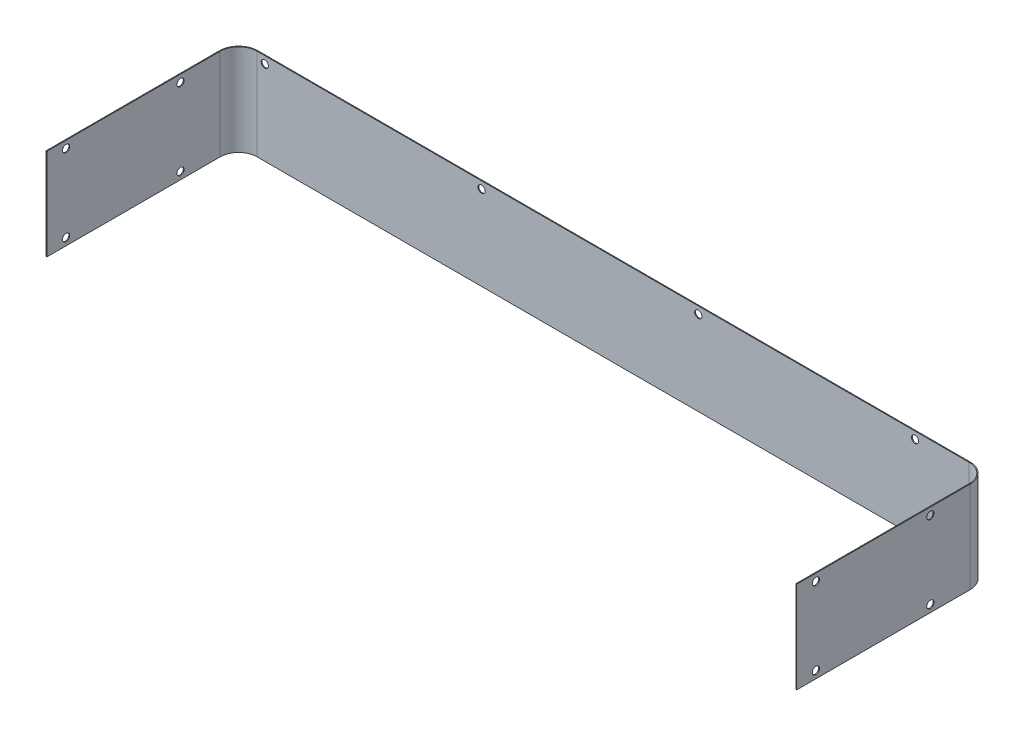
ISO-10303-21;
HEADER;
FILE_DESCRIPTION(('STEP AP214'),'2;1');
FILE_NAME('part.step','',(''),(''),'','','');
FILE_SCHEMA(('AUTOMOTIVE_DESIGN { 1 0 10303 214 1 1 1 1 }'));
ENDSEC;
DATA;
#1=APPLICATION_CONTEXT('core data for automotive mechanical design processes');
#2=APPLICATION_PROTOCOL_DEFINITION('international standard','automotive_design',2000,#1);
#3=PRODUCT_CONTEXT('',#1,'mechanical');
#4=PRODUCT('Part','Part','',(#3));
#5=PRODUCT_RELATED_PRODUCT_CATEGORY('part','',(#4));
#6=PRODUCT_DEFINITION_FORMATION('','',#4);
#7=PRODUCT_DEFINITION_CONTEXT('part definition',#1,'design');
#8=PRODUCT_DEFINITION('design','',#6,#7);
#9=PRODUCT_DEFINITION_SHAPE('','',#8);
#10=(LENGTH_UNIT() NAMED_UNIT(*) SI_UNIT(.MILLI.,.METRE.));
#11=(NAMED_UNIT(*) PLANE_ANGLE_UNIT() SI_UNIT($,.RADIAN.));
#12=(NAMED_UNIT(*) SI_UNIT($,.STERADIAN.) SOLID_ANGLE_UNIT());
#13=UNCERTAINTY_MEASURE_WITH_UNIT(LENGTH_MEASURE(1.E-05),#10,'distance_accuracy_value','');
#14=(GEOMETRIC_REPRESENTATION_CONTEXT(3) GLOBAL_UNCERTAINTY_ASSIGNED_CONTEXT((#13)) GLOBAL_UNIT_ASSIGNED_CONTEXT((#10,
#11,#12)) REPRESENTATION_CONTEXT('',''));
#15=CARTESIAN_POINT('',(0.,0.,0.));
#16=DIRECTION('',(0.,0.,1.));
#17=DIRECTION('',(1.,0.,0.));
#18=AXIS2_PLACEMENT_3D('',#15,#16,#17);
#19=CARTESIAN_POINT('',(16.,76.,-160.));
#20=DIRECTION('',(0.,1.,0.));
#21=DIRECTION('',(0.,0.,1.));
#22=AXIS2_PLACEMENT_3D('',#19,#20,#21);
#23=PLANE('',#22);
#24=DIRECTION('',(0.,0.,1.));
#25=VECTOR('',#24,1.);
#26=CARTESIAN_POINT('',(16.,76.,-160.));
#27=LINE('',#26,#25);
#28=CARTESIAN_POINT('',(16.,76.,-160.));
#29=VERTEX_POINT('',#28);
#30=CARTESIAN_POINT('',(16.,76.,-159.3));
#31=VERTEX_POINT('',#30);
#32=EDGE_CURVE('E11',#29,#31,#27,.T.);
#33=ORIENTED_EDGE('',*,*,#32,.F.);
#34=CARTESIAN_POINT('',(16.,76.,-144.));
#35=DIRECTION('',(0.,-1.,0.));
#36=DIRECTION('',(0.,0.,-1.));
#37=AXIS2_PLACEMENT_3D('',#34,#35,#36);
#38=CIRCLE('',#37,16.);
#39=CARTESIAN_POINT('',(0.,76.,-144.));
#40=VERTEX_POINT('',#39);
#41=EDGE_CURVE('E305',#40,#29,#38,.T.);
#42=ORIENTED_EDGE('',*,*,#41,.F.);
#43=DIRECTION('',(-1.,0.,0.));
#44=VECTOR('',#43,1.);
#45=CARTESIAN_POINT('',(0.70000000000002,76.,-144.));
#46=LINE('',#45,#44);
#47=CARTESIAN_POINT('',(0.70000000000002,76.,-144.));
#48=VERTEX_POINT('',#47);
#49=EDGE_CURVE('E47',#48,#40,#46,.T.);
#50=ORIENTED_EDGE('',*,*,#49,.F.);
#51=CARTESIAN_POINT('',(16.,76.,-144.));
#52=DIRECTION('',(0.,1.,0.));
#53=DIRECTION('',(1.,0.,0.));
#54=AXIS2_PLACEMENT_3D('',#51,#52,#53);
#55=CIRCLE('',#54,15.3);
#56=EDGE_CURVE('E149',#48,#31,#55,.F.);
#57=ORIENTED_EDGE('',*,*,#56,.T.);
#58=EDGE_LOOP('',(#33,#42,#50,#57));
#59=FACE_BOUND('',#58,.T.);
#60=ADVANCED_FACE('F38',(#59),#23,.T.);
#61=CARTESIAN_POINT('',(0.70000000000002,76.,-144.));
#62=DIRECTION('',(0.,1.,0.));
#63=DIRECTION('',(0.,0.,1.));
#64=AXIS2_PLACEMENT_3D('',#61,#62,#63);
#65=PLANE('',#64);
#66=DIRECTION('',(1.,0.,0.));
#67=VECTOR('',#66,1.);
#68=CARTESIAN_POINT('',(16.,76.,-160.));
#69=LINE('',#68,#67);
#70=CARTESIAN_POINT('',(607.4,76.,-160.));
#71=VERTEX_POINT('',#70);
#72=EDGE_CURVE('E143',#29,#71,#69,.T.);
#73=ORIENTED_EDGE('',*,*,#72,.F.);
#74=ORIENTED_EDGE('',*,*,#32,.T.);
#75=DIRECTION('',(1.,0.,0.));
#76=VECTOR('',#75,1.);
#77=CARTESIAN_POINT('',(16.,76.,-159.3));
#78=LINE('',#77,#76);
#79=CARTESIAN_POINT('',(607.4,76.,-159.3));
#80=VERTEX_POINT('',#79);
#81=EDGE_CURVE('E140',#31,#80,#78,.T.);
#82=ORIENTED_EDGE('',*,*,#81,.T.);
#83=DIRECTION('',(0.,0.,-1.));
#84=VECTOR('',#83,1.);
#85=CARTESIAN_POINT('',(607.4,76.,-159.3));
#86=LINE('',#85,#84);
#87=EDGE_CURVE('E232',#80,#71,#86,.T.);
#88=ORIENTED_EDGE('',*,*,#87,.T.);
#89=EDGE_LOOP('',(#73,#74,#82,#88));
#90=FACE_BOUND('',#89,.T.);
#91=ADVANCED_FACE('F138',(#90),#65,.T.);
#92=CARTESIAN_POINT('',(0.,0.,-144.));
#93=DIRECTION('',(0.,-1.,0.));
#94=DIRECTION('',(0.,0.,-1.));
#95=AXIS2_PLACEMENT_3D('',#92,#93,#94);
#96=PLANE('',#95);
#97=DIRECTION('',(1.,0.,0.));
#98=VECTOR('',#97,1.);
#99=CARTESIAN_POINT('',(0.,0.,-144.));
#100=LINE('',#99,#98);
#101=CARTESIAN_POINT('',(0.,0.,-144.));
#102=VERTEX_POINT('',#101);
#103=CARTESIAN_POINT('',(0.70000000000002,0.,-144.));
#104=VERTEX_POINT('',#103);
#105=EDGE_CURVE('E237',#102,#104,#100,.T.);
#106=ORIENTED_EDGE('',*,*,#105,.F.);
#107=CARTESIAN_POINT('',(16.,0.,-144.));
#108=DIRECTION('',(0.,-1.,0.));
#109=DIRECTION('',(0.,0.,-1.));
#110=AXIS2_PLACEMENT_3D('',#107,#108,#109);
#111=CIRCLE('',#110,16.);
#112=CARTESIAN_POINT('',(16.,0.,-160.));
#113=VERTEX_POINT('',#112);
#114=EDGE_CURVE('E189',#102,#113,#111,.T.);
#115=ORIENTED_EDGE('',*,*,#114,.T.);
#116=DIRECTION('',(0.,0.,-1.));
#117=VECTOR('',#116,1.);
#118=CARTESIAN_POINT('',(16.,0.,-159.3));
#119=LINE('',#118,#117);
#120=CARTESIAN_POINT('',(16.,0.,-159.3));
#121=VERTEX_POINT('',#120);
#122=EDGE_CURVE('E235',#121,#113,#119,.T.);
#123=ORIENTED_EDGE('',*,*,#122,.F.);
#124=CARTESIAN_POINT('',(16.,0.,-144.));
#125=DIRECTION('',(0.,1.,0.));
#126=DIRECTION('',(1.,0.,0.));
#127=AXIS2_PLACEMENT_3D('',#124,#125,#126);
#128=CIRCLE('',#127,15.3);
#129=EDGE_CURVE('E161',#104,#121,#128,.F.);
#130=ORIENTED_EDGE('',*,*,#129,.F.);
#131=EDGE_LOOP('',(#106,#115,#123,#130));
#132=FACE_BOUND('',#131,.T.);
#133=ADVANCED_FACE('F323',(#132),#96,.T.);
#134=CARTESIAN_POINT('',(16.,0.,-159.3));
#135=DIRECTION('',(0.,-1.,0.));
#136=DIRECTION('',(0.,0.,-1.));
#137=AXIS2_PLACEMENT_3D('',#134,#135,#136);
#138=PLANE('',#137);
#139=DIRECTION('',(0.,0.,-1.));
#140=VECTOR('',#139,1.);
#141=CARTESIAN_POINT('',(0.,0.,0.));
#142=LINE('',#141,#140);
#143=CARTESIAN_POINT('',(0.,0.,0.));
#144=VERTEX_POINT('',#143);
#145=EDGE_CURVE('E192',#144,#102,#142,.T.);
#146=ORIENTED_EDGE('',*,*,#145,.T.);
#147=ORIENTED_EDGE('',*,*,#105,.T.);
#148=DIRECTION('',(0.,0.,-1.));
#149=VECTOR('',#148,1.);
#150=CARTESIAN_POINT('',(0.7,0.,0.));
#151=LINE('',#150,#149);
#152=CARTESIAN_POINT('',(0.7,0.,0.));
#153=VERTEX_POINT('',#152);
#154=EDGE_CURVE('E198',#153,#104,#151,.T.);
#155=ORIENTED_EDGE('',*,*,#154,.F.);
#156=DIRECTION('',(-1.,0.,0.));
#157=VECTOR('',#156,1.);
#158=CARTESIAN_POINT('',(0.7,0.,0.));
#159=LINE('',#158,#157);
#160=EDGE_CURVE('E195',#153,#144,#159,.T.);
#161=ORIENTED_EDGE('',*,*,#160,.T.);
#162=EDGE_LOOP('',(#146,#147,#155,#161));
#163=FACE_BOUND('',#162,.T.);
#164=ADVANCED_FACE('F370',(#163),#138,.T.);
#165=CARTESIAN_POINT('',(623.4,76.,-144.));
#166=DIRECTION('',(0.,1.,0.));
#167=DIRECTION('',(0.,0.,1.));
#168=AXIS2_PLACEMENT_3D('',#165,#166,#167);
#169=PLANE('',#168);
#170=DIRECTION('',(-1.,0.,0.));
#171=VECTOR('',#170,1.);
#172=CARTESIAN_POINT('',(623.4,76.,-144.));
#173=LINE('',#172,#171);
#174=CARTESIAN_POINT('',(623.4,76.,-144.));
#175=VERTEX_POINT('',#174);
#176=CARTESIAN_POINT('',(622.7,76.,-144.));
#177=VERTEX_POINT('',#176);
#178=EDGE_CURVE('E56',#175,#177,#173,.T.);
#179=ORIENTED_EDGE('',*,*,#178,.F.);
#180=CARTESIAN_POINT('',(607.4,76.,-144.));
#181=DIRECTION('',(0.,-1.,0.));
#182=DIRECTION('',(0.,0.,-1.));
#183=AXIS2_PLACEMENT_3D('',#180,#181,#182);
#184=CIRCLE('',#183,16.);
#185=EDGE_CURVE('E301',#71,#175,#184,.T.);
#186=ORIENTED_EDGE('',*,*,#185,.F.);
#187=ORIENTED_EDGE('',*,*,#87,.F.);
#188=CARTESIAN_POINT('',(607.4,76.,-144.));
#189=DIRECTION('',(0.,1.,0.));
#190=DIRECTION('',(1.,0.,0.));
#191=AXIS2_PLACEMENT_3D('',#188,#189,#190);
#192=CIRCLE('',#191,15.3);
#193=EDGE_CURVE('E169',#80,#177,#192,.F.);
#194=ORIENTED_EDGE('',*,*,#193,.T.);
#195=EDGE_LOOP('',(#179,#186,#187,#194));
#196=FACE_BOUND('',#195,.T.);
#197=ADVANCED_FACE('F375',(#196),#169,.T.);
#198=CARTESIAN_POINT('',(607.4,76.,-159.3));
#199=DIRECTION('',(0.,1.,0.));
#200=DIRECTION('',(0.,0.,1.));
#201=AXIS2_PLACEMENT_3D('',#198,#199,#200);
#202=PLANE('',#201);
#203=DIRECTION('',(0.,0.,1.));
#204=VECTOR('',#203,1.);
#205=CARTESIAN_POINT('',(623.4,76.,-144.));
#206=LINE('',#205,#204);
#207=CARTESIAN_POINT('',(623.4,76.,0.));
#208=VERTEX_POINT('',#207);
#209=EDGE_CURVE('E298',#175,#208,#206,.T.);
#210=ORIENTED_EDGE('',*,*,#209,.F.);
#211=ORIENTED_EDGE('',*,*,#178,.T.);
#212=DIRECTION('',(0.,0.,-1.));
#213=VECTOR('',#212,1.);
#214=CARTESIAN_POINT('',(622.7,76.,-144.));
#215=LINE('',#214,#213);
#216=CARTESIAN_POINT('',(622.7,76.,0.));
#217=VERTEX_POINT('',#216);
#218=EDGE_CURVE('E110',#177,#217,#215,.F.);
#219=ORIENTED_EDGE('',*,*,#218,.T.);
#220=DIRECTION('',(-1.,0.,0.));
#221=VECTOR('',#220,1.);
#222=CARTESIAN_POINT('',(623.4,76.,0.));
#223=LINE('',#222,#221);
#224=EDGE_CURVE('E295',#208,#217,#223,.T.);
#225=ORIENTED_EDGE('',*,*,#224,.F.);
#226=EDGE_LOOP('',(#210,#211,#219,#225));
#227=FACE_BOUND('',#226,.T.);
#228=ADVANCED_FACE('F350',(#227),#202,.T.);
#229=CARTESIAN_POINT('',(607.4,0.,-160.));
#230=DIRECTION('',(0.,-1.,0.));
#231=DIRECTION('',(0.,0.,-1.));
#232=AXIS2_PLACEMENT_3D('',#229,#230,#231);
#233=PLANE('',#232);
#234=DIRECTION('',(0.,0.,1.));
#235=VECTOR('',#234,1.);
#236=CARTESIAN_POINT('',(607.4,0.,-160.));
#237=LINE('',#236,#235);
#238=CARTESIAN_POINT('',(607.4,0.,-160.));
#239=VERTEX_POINT('',#238);
#240=CARTESIAN_POINT('',(607.4,0.,-159.3));
#241=VERTEX_POINT('',#240);
#242=EDGE_CURVE('E97',#239,#241,#237,.T.);
#243=ORIENTED_EDGE('',*,*,#242,.F.);
#244=CARTESIAN_POINT('',(607.4,0.,-144.));
#245=DIRECTION('',(0.,-1.,0.));
#246=DIRECTION('',(0.,0.,-1.));
#247=AXIS2_PLACEMENT_3D('',#244,#245,#246);
#248=CIRCLE('',#247,16.);
#249=CARTESIAN_POINT('',(623.4,0.,-144.));
#250=VERTEX_POINT('',#249);
#251=EDGE_CURVE('E185',#239,#250,#248,.T.);
#252=ORIENTED_EDGE('',*,*,#251,.T.);
#253=DIRECTION('',(1.,0.,0.));
#254=VECTOR('',#253,1.);
#255=CARTESIAN_POINT('',(622.7,0.,-144.));
#256=LINE('',#255,#254);
#257=CARTESIAN_POINT('',(622.7,0.,-144.));
#258=VERTEX_POINT('',#257);
#259=EDGE_CURVE('E104',#258,#250,#256,.T.);
#260=ORIENTED_EDGE('',*,*,#259,.F.);
#261=CARTESIAN_POINT('',(607.4,0.,-144.));
#262=DIRECTION('',(0.,1.,0.));
#263=DIRECTION('',(1.,0.,0.));
#264=AXIS2_PLACEMENT_3D('',#261,#262,#263);
#265=CIRCLE('',#264,15.3);
#266=EDGE_CURVE('E204',#241,#258,#265,.F.);
#267=ORIENTED_EDGE('',*,*,#266,.F.);
#268=EDGE_LOOP('',(#243,#252,#260,#267));
#269=FACE_BOUND('',#268,.T.);
#270=ADVANCED_FACE('F338',(#269),#233,.T.);
#271=CARTESIAN_POINT('',(622.7,0.,-144.));
#272=DIRECTION('',(0.,-1.,0.));
#273=DIRECTION('',(0.,0.,-1.));
#274=AXIS2_PLACEMENT_3D('',#271,#272,#273);
#275=PLANE('',#274);
#276=DIRECTION('',(1.,0.,0.));
#277=VECTOR('',#276,1.);
#278=CARTESIAN_POINT('',(16.,0.,-160.));
#279=LINE('',#278,#277);
#280=EDGE_CURVE('E187',#113,#239,#279,.T.);
#281=ORIENTED_EDGE('',*,*,#280,.T.);
#282=ORIENTED_EDGE('',*,*,#242,.T.);
#283=DIRECTION('',(1.,0.,0.));
#284=VECTOR('',#283,1.);
#285=CARTESIAN_POINT('',(16.,0.,-159.3));
#286=LINE('',#285,#284);
#287=EDGE_CURVE('E202',#121,#241,#286,.T.);
#288=ORIENTED_EDGE('',*,*,#287,.F.);
#289=ORIENTED_EDGE('',*,*,#122,.T.);
#290=EDGE_LOOP('',(#281,#282,#288,#289));
#291=FACE_BOUND('',#290,.T.);
#292=ADVANCED_FACE('F325',(#291),#275,.T.);
#293=CARTESIAN_POINT('',(622.7,76.,-144.));
#294=DIRECTION('',(1.,0.,0.));
#295=DIRECTION('',(0.,0.,-1.));
#296=AXIS2_PLACEMENT_3D('',#293,#294,#295);
#297=PLANE('',#296);
#298=CARTESIAN_POINT('',(622.7,6.00000000000003,-16.));
#299=DIRECTION('',(1.,0.,0.));
#300=DIRECTION('',(0.,0.,-1.));
#301=AXIS2_PLACEMENT_3D('',#298,#299,#300);
#302=CIRCLE('',#301,3.);
#303=CARTESIAN_POINT('',(622.7,6.00000000000003,-19.));
#304=VERTEX_POINT('',#303);
#305=EDGE_CURVE('E179',#304,#304,#302,.T.);
#306=ORIENTED_EDGE('',*,*,#305,.T.);
#307=EDGE_LOOP('',(#306));
#308=FACE_BOUND('',#307,.T.);
#309=CARTESIAN_POINT('',(622.7,6.00000000000001,-111.));
#310=DIRECTION('',(1.,0.,0.));
#311=DIRECTION('',(0.,0.,-1.));
#312=AXIS2_PLACEMENT_3D('',#309,#310,#311);
#313=CIRCLE('',#312,3.00000000000001);
#314=CARTESIAN_POINT('',(622.7,6.00000000000001,-114.));
#315=VERTEX_POINT('',#314);
#316=EDGE_CURVE('E252',#315,#315,#313,.T.);
#317=ORIENTED_EDGE('',*,*,#316,.T.);
#318=EDGE_LOOP('',(#317));
#319=FACE_BOUND('',#318,.T.);
#320=CARTESIAN_POINT('',(622.7,70.,-111.));
#321=DIRECTION('',(1.,0.,0.));
#322=DIRECTION('',(0.,0.,-1.));
#323=AXIS2_PLACEMENT_3D('',#320,#321,#322);
#324=CIRCLE('',#323,3.00000000000001);
#325=CARTESIAN_POINT('',(622.7,70.,-114.));
#326=VERTEX_POINT('',#325);
#327=EDGE_CURVE('E248',#326,#326,#324,.T.);
#328=ORIENTED_EDGE('',*,*,#327,.T.);
#329=EDGE_LOOP('',(#328));
#330=FACE_BOUND('',#329,.T.);
#331=CARTESIAN_POINT('',(622.7,70.,-16.));
#332=DIRECTION('',(1.,0.,0.));
#333=DIRECTION('',(0.,0.,-1.));
#334=AXIS2_PLACEMENT_3D('',#331,#332,#333);
#335=CIRCLE('',#334,3.);
#336=CARTESIAN_POINT('',(622.7,70.,-19.));
#337=VERTEX_POINT('',#336);
#338=EDGE_CURVE('E243',#337,#337,#335,.T.);
#339=ORIENTED_EDGE('',*,*,#338,.T.);
#340=EDGE_LOOP('',(#339));
#341=FACE_BOUND('',#340,.T.);
#342=DIRECTION('',(0.,0.,-1.));
#343=VECTOR('',#342,1.);
#344=CARTESIAN_POINT('',(622.7,0.,-144.));
#345=LINE('',#344,#343);
#346=CARTESIAN_POINT('',(622.7,0.,0.));
#347=VERTEX_POINT('',#346);
#348=EDGE_CURVE('E175',#258,#347,#345,.F.);
#349=ORIENTED_EDGE('',*,*,#348,.T.);
#350=DIRECTION('',(0.,-1.,0.));
#351=VECTOR('',#350,1.);
#352=CARTESIAN_POINT('',(622.7,76.,0.));
#353=LINE('',#352,#351);
#354=EDGE_CURVE('E228',#217,#347,#353,.T.);
#355=ORIENTED_EDGE('',*,*,#354,.F.);
#356=ORIENTED_EDGE('',*,*,#218,.F.);
#357=DIRECTION('',(0.,-1.,0.));
#358=VECTOR('',#357,1.);
#359=CARTESIAN_POINT('',(622.7,76.,-144.));
#360=LINE('',#359,#358);
#361=EDGE_CURVE('E171',#177,#258,#360,.T.);
#362=ORIENTED_EDGE('',*,*,#361,.T.);
#363=EDGE_LOOP('',(#349,#355,#356,#362));
#364=FACE_BOUND('',#363,.T.);
#365=ADVANCED_FACE('F344',(#308,#319,#330,#341,#364),#297,.F.);
#366=CARTESIAN_POINT('',(623.4,76.,0.));
#367=DIRECTION('',(0.,0.,1.));
#368=DIRECTION('',(1.,0.,0.));
#369=AXIS2_PLACEMENT_3D('',#366,#367,#368);
#370=PLANE('',#369);
#371=DIRECTION('',(-1.,0.,0.));
#372=VECTOR('',#371,1.);
#373=CARTESIAN_POINT('',(623.4,0.,0.));
#374=LINE('',#373,#372);
#375=CARTESIAN_POINT('',(623.4,0.,0.));
#376=VERTEX_POINT('',#375);
#377=EDGE_CURVE('E178',#376,#347,#374,.T.);
#378=ORIENTED_EDGE('',*,*,#377,.F.);
#379=DIRECTION('',(0.,-1.,0.));
#380=VECTOR('',#379,1.);
#381=CARTESIAN_POINT('',(623.4,76.,0.));
#382=LINE('',#381,#380);
#383=EDGE_CURVE('E226',#208,#376,#382,.T.);
#384=ORIENTED_EDGE('',*,*,#383,.F.);
#385=ORIENTED_EDGE('',*,*,#224,.T.);
#386=ORIENTED_EDGE('',*,*,#354,.T.);
#387=EDGE_LOOP('',(#378,#384,#385,#386));
#388=FACE_BOUND('',#387,.T.);
#389=ADVANCED_FACE('F349',(#388),#370,.T.);
#390=CARTESIAN_POINT('',(623.4,76.,-144.));
#391=DIRECTION('',(1.,0.,0.));
#392=DIRECTION('',(0.,0.,-1.));
#393=AXIS2_PLACEMENT_3D('',#390,#391,#392);
#394=PLANE('',#393);
#395=CARTESIAN_POINT('',(623.4,6.00000000000003,-16.));
#396=DIRECTION('',(1.,0.,0.));
#397=DIRECTION('',(0.,0.,1.));
#398=AXIS2_PLACEMENT_3D('',#395,#396,#397);
#399=CIRCLE('',#398,3.);
#400=CARTESIAN_POINT('',(623.4,6.00000000000003,-13.));
#401=VERTEX_POINT('',#400);
#402=EDGE_CURVE('E267',#401,#401,#399,.T.);
#403=ORIENTED_EDGE('',*,*,#402,.F.);
#404=EDGE_LOOP('',(#403));
#405=FACE_BOUND('',#404,.T.);
#406=CARTESIAN_POINT('',(623.4,6.00000000000001,-111.));
#407=DIRECTION('',(1.,0.,0.));
#408=DIRECTION('',(0.,0.,1.));
#409=AXIS2_PLACEMENT_3D('',#406,#407,#408);
#410=CIRCLE('',#409,3.00000000000001);
#411=CARTESIAN_POINT('',(623.4,6.00000000000001,-108.));
#412=VERTEX_POINT('',#411);
#413=EDGE_CURVE('E276',#412,#412,#410,.T.);
#414=ORIENTED_EDGE('',*,*,#413,.F.);
#415=EDGE_LOOP('',(#414));
#416=FACE_BOUND('',#415,.T.);
#417=CARTESIAN_POINT('',(623.4,70.,-111.));
#418=DIRECTION('',(1.,0.,0.));
#419=DIRECTION('',(0.,0.,-1.));
#420=AXIS2_PLACEMENT_3D('',#417,#418,#419);
#421=CIRCLE('',#420,3.00000000000001);
#422=CARTESIAN_POINT('',(623.4,70.,-114.));
#423=VERTEX_POINT('',#422);
#424=EDGE_CURVE('E476',#423,#423,#421,.T.);
#425=ORIENTED_EDGE('',*,*,#424,.F.);
#426=EDGE_LOOP('',(#425));
#427=FACE_BOUND('',#426,.T.);
#428=CARTESIAN_POINT('',(623.4,70.,-16.));
#429=DIRECTION('',(1.,0.,0.));
#430=DIRECTION('',(0.,0.,-1.));
#431=AXIS2_PLACEMENT_3D('',#428,#429,#430);
#432=CIRCLE('',#431,3.);
#433=CARTESIAN_POINT('',(623.4,70.,-19.));
#434=VERTEX_POINT('',#433);
#435=EDGE_CURVE('E282',#434,#434,#432,.T.);
#436=ORIENTED_EDGE('',*,*,#435,.F.);
#437=EDGE_LOOP('',(#436));
#438=FACE_BOUND('',#437,.T.);
#439=DIRECTION('',(0.,0.,1.));
#440=VECTOR('',#439,1.);
#441=CARTESIAN_POINT('',(623.4,0.,-144.));
#442=LINE('',#441,#440);
#443=EDGE_CURVE('E182',#250,#376,#442,.T.);
#444=ORIENTED_EDGE('',*,*,#443,.F.);
#445=DIRECTION('',(0.,-1.,0.));
#446=VECTOR('',#445,1.);
#447=CARTESIAN_POINT('',(623.4,76.,-144.));
#448=LINE('',#447,#446);
#449=EDGE_CURVE('E223',#175,#250,#448,.T.);
#450=ORIENTED_EDGE('',*,*,#449,.F.);
#451=ORIENTED_EDGE('',*,*,#209,.T.);
#452=ORIENTED_EDGE('',*,*,#383,.T.);
#453=EDGE_LOOP('',(#444,#450,#451,#452));
#454=FACE_BOUND('',#453,.T.);
#455=ADVANCED_FACE('F352',(#405,#416,#427,#438,#454),#394,.T.);
#456=CARTESIAN_POINT('',(607.4,76.,-144.));
#457=DIRECTION('',(0.,-1.,0.));
#458=DIRECTION('',(0.,0.,-1.));
#459=AXIS2_PLACEMENT_3D('',#456,#457,#458);
#460=CYLINDRICAL_SURFACE('',#459,16.);
#461=ORIENTED_EDGE('',*,*,#251,.F.);
#462=DIRECTION('',(0.,-1.,0.));
#463=VECTOR('',#462,1.);
#464=CARTESIAN_POINT('',(607.4,76.,-160.));
#465=LINE('',#464,#463);
#466=EDGE_CURVE('E220',#71,#239,#465,.T.);
#467=ORIENTED_EDGE('',*,*,#466,.F.);
#468=ORIENTED_EDGE('',*,*,#185,.T.);
#469=ORIENTED_EDGE('',*,*,#449,.T.);
#470=EDGE_LOOP('',(#461,#467,#468,#469));
#471=FACE_BOUND('',#470,.T.);
#472=ADVANCED_FACE('F335',(#471),#460,.T.);
#473=CARTESIAN_POINT('',(16.,76.,-160.));
#474=DIRECTION('',(0.,0.,-1.));
#475=DIRECTION('',(-1.,0.,0.));
#476=AXIS2_PLACEMENT_3D('',#473,#474,#475);
#477=PLANE('',#476);
#478=CARTESIAN_POINT('',(22.4000000000005,70.,-160.));
#479=DIRECTION('',(0.,0.,-1.));
#480=DIRECTION('',(-1.,0.,0.));
#481=AXIS2_PLACEMENT_3D('',#478,#479,#480);
#482=CIRCLE('',#481,2.99999999999994);
#483=CARTESIAN_POINT('',(19.4000000000006,70.,-160.));
#484=VERTEX_POINT('',#483);
#485=EDGE_CURVE('E457',#484,#484,#482,.T.);
#486=ORIENTED_EDGE('',*,*,#485,.F.);
#487=EDGE_LOOP('',(#486));
#488=FACE_BOUND('',#487,.T.);
#489=CARTESIAN_POINT('',(202.4,70.,-160.));
#490=DIRECTION('',(0.,0.,-1.));
#491=DIRECTION('',(-1.,0.,0.));
#492=AXIS2_PLACEMENT_3D('',#489,#490,#491);
#493=CIRCLE('',#492,2.99999999999994);
#494=CARTESIAN_POINT('',(199.4,70.,-160.));
#495=VERTEX_POINT('',#494);
#496=EDGE_CURVE('E461',#495,#495,#493,.T.);
#497=ORIENTED_EDGE('',*,*,#496,.F.);
#498=EDGE_LOOP('',(#497));
#499=FACE_BOUND('',#498,.T.);
#500=CARTESIAN_POINT('',(382.4,70.,-160.));
#501=DIRECTION('',(0.,0.,-1.));
#502=DIRECTION('',(-1.,0.,0.));
#503=AXIS2_PLACEMENT_3D('',#500,#501,#502);
#504=CIRCLE('',#503,2.99999999999994);
#505=CARTESIAN_POINT('',(379.4,70.,-160.));
#506=VERTEX_POINT('',#505);
#507=EDGE_CURVE('E465',#506,#506,#504,.T.);
#508=ORIENTED_EDGE('',*,*,#507,.F.);
#509=EDGE_LOOP('',(#508));
#510=FACE_BOUND('',#509,.T.);
#511=CARTESIAN_POINT('',(562.4,70.,-160.));
#512=DIRECTION('',(0.,0.,-1.));
#513=DIRECTION('',(-1.,0.,0.));
#514=AXIS2_PLACEMENT_3D('',#511,#512,#513);
#515=CIRCLE('',#514,2.99999999999993);
#516=CARTESIAN_POINT('',(559.4,70.,-160.));
#517=VERTEX_POINT('',#516);
#518=EDGE_CURVE('E260',#517,#517,#515,.T.);
#519=ORIENTED_EDGE('',*,*,#518,.F.);
#520=EDGE_LOOP('',(#519));
#521=FACE_BOUND('',#520,.T.);
#522=ORIENTED_EDGE('',*,*,#280,.F.);
#523=DIRECTION('',(0.,-1.,0.));
#524=VECTOR('',#523,1.);
#525=CARTESIAN_POINT('',(16.,76.,-160.));
#526=LINE('',#525,#524);
#527=EDGE_CURVE('E217',#29,#113,#526,.T.);
#528=ORIENTED_EDGE('',*,*,#527,.F.);
#529=ORIENTED_EDGE('',*,*,#72,.T.);
#530=ORIENTED_EDGE('',*,*,#466,.T.);
#531=EDGE_LOOP('',(#522,#528,#529,#530));
#532=FACE_BOUND('',#531,.T.);
#533=ADVANCED_FACE('F330',(#488,#499,#510,#521,#532),#477,.T.);
#534=CARTESIAN_POINT('',(16.,76.,-144.));
#535=DIRECTION('',(0.,-1.,0.));
#536=DIRECTION('',(0.,0.,-1.));
#537=AXIS2_PLACEMENT_3D('',#534,#535,#536);
#538=CYLINDRICAL_SURFACE('',#537,16.);
#539=ORIENTED_EDGE('',*,*,#114,.F.);
#540=DIRECTION('',(0.,-1.,0.));
#541=VECTOR('',#540,1.);
#542=CARTESIAN_POINT('',(0.,76.,-144.));
#543=LINE('',#542,#541);
#544=EDGE_CURVE('E214',#40,#102,#543,.T.);
#545=ORIENTED_EDGE('',*,*,#544,.F.);
#546=ORIENTED_EDGE('',*,*,#41,.T.);
#547=ORIENTED_EDGE('',*,*,#527,.T.);
#548=EDGE_LOOP('',(#539,#545,#546,#547));
#549=FACE_BOUND('',#548,.T.);
#550=ADVANCED_FACE('F328',(#549),#538,.T.);
#551=CARTESIAN_POINT('',(0.,76.,0.));
#552=DIRECTION('',(-1.,0.,0.));
#553=DIRECTION('',(0.,0.,1.));
#554=AXIS2_PLACEMENT_3D('',#551,#552,#553);
#555=PLANE('',#554);
#556=CARTESIAN_POINT('',(0.,6.00000000000003,-16.));
#557=DIRECTION('',(1.,0.,0.));
#558=DIRECTION('',(0.,0.,1.));
#559=AXIS2_PLACEMENT_3D('',#556,#557,#558);
#560=CIRCLE('',#559,3.);
#561=CARTESIAN_POINT('',(0.,6.00000000000003,-13.));
#562=VERTEX_POINT('',#561);
#563=EDGE_CURVE('E271',#562,#562,#560,.T.);
#564=ORIENTED_EDGE('',*,*,#563,.T.);
#565=EDGE_LOOP('',(#564));
#566=FACE_BOUND('',#565,.T.);
#567=CARTESIAN_POINT('',(0.,6.00000000000001,-111.));
#568=DIRECTION('',(1.,0.,0.));
#569=DIRECTION('',(0.,0.,1.));
#570=AXIS2_PLACEMENT_3D('',#567,#568,#569);
#571=CIRCLE('',#570,3.00000000000001);
#572=CARTESIAN_POINT('',(0.,6.00000000000001,-108.));
#573=VERTEX_POINT('',#572);
#574=EDGE_CURVE('E479',#573,#573,#571,.T.);
#575=ORIENTED_EDGE('',*,*,#574,.T.);
#576=EDGE_LOOP('',(#575));
#577=FACE_BOUND('',#576,.T.);
#578=CARTESIAN_POINT('',(0.,70.,-111.));
#579=DIRECTION('',(1.,0.,0.));
#580=DIRECTION('',(0.,0.,-1.));
#581=AXIS2_PLACEMENT_3D('',#578,#579,#580);
#582=CIRCLE('',#581,3.00000000000001);
#583=CARTESIAN_POINT('',(0.,70.,-114.));
#584=VERTEX_POINT('',#583);
#585=EDGE_CURVE('E285',#584,#584,#582,.T.);
#586=ORIENTED_EDGE('',*,*,#585,.T.);
#587=EDGE_LOOP('',(#586));
#588=FACE_BOUND('',#587,.T.);
#589=CARTESIAN_POINT('',(0.,70.,-16.));
#590=DIRECTION('',(1.,0.,0.));
#591=DIRECTION('',(0.,0.,-1.));
#592=AXIS2_PLACEMENT_3D('',#589,#590,#591);
#593=CIRCLE('',#592,3.);
#594=CARTESIAN_POINT('',(0.,70.,-19.));
#595=VERTEX_POINT('',#594);
#596=EDGE_CURVE('E244',#595,#595,#593,.T.);
#597=ORIENTED_EDGE('',*,*,#596,.T.);
#598=EDGE_LOOP('',(#597));
#599=FACE_BOUND('',#598,.T.);
#600=ORIENTED_EDGE('',*,*,#145,.F.);
#601=DIRECTION('',(0.,-1.,0.));
#602=VECTOR('',#601,1.);
#603=CARTESIAN_POINT('',(0.,76.,0.));
#604=LINE('',#603,#602);
#605=CARTESIAN_POINT('',(0.,76.,0.));
#606=VERTEX_POINT('',#605);
#607=EDGE_CURVE('E212',#606,#144,#604,.T.);
#608=ORIENTED_EDGE('',*,*,#607,.F.);
#609=DIRECTION('',(0.,0.,-1.));
#610=VECTOR('',#609,1.);
#611=CARTESIAN_POINT('',(0.,76.,0.));
#612=LINE('',#611,#610);
#613=EDGE_CURVE('E307',#606,#40,#612,.T.);
#614=ORIENTED_EDGE('',*,*,#613,.T.);
#615=ORIENTED_EDGE('',*,*,#544,.T.);
#616=EDGE_LOOP('',(#600,#608,#614,#615));
#617=FACE_BOUND('',#616,.T.);
#618=ADVANCED_FACE('F439',(#566,#577,#588,#599,#617),#555,.T.);
#619=CARTESIAN_POINT('',(0.7,76.,0.));
#620=DIRECTION('',(0.,0.,1.));
#621=DIRECTION('',(1.,0.,0.));
#622=AXIS2_PLACEMENT_3D('',#619,#620,#621);
#623=PLANE('',#622);
#624=ORIENTED_EDGE('',*,*,#160,.F.);
#625=DIRECTION('',(0.,-1.,0.));
#626=VECTOR('',#625,1.);
#627=CARTESIAN_POINT('',(0.7,76.,0.));
#628=LINE('',#627,#626);
#629=CARTESIAN_POINT('',(0.7,76.,0.));
#630=VERTEX_POINT('',#629);
#631=EDGE_CURVE('E210',#630,#153,#628,.T.);
#632=ORIENTED_EDGE('',*,*,#631,.F.);
#633=DIRECTION('',(-1.,0.,0.));
#634=VECTOR('',#633,1.);
#635=CARTESIAN_POINT('',(0.7,76.,0.));
#636=LINE('',#635,#634);
#637=EDGE_CURVE('E310',#630,#606,#636,.T.);
#638=ORIENTED_EDGE('',*,*,#637,.T.);
#639=ORIENTED_EDGE('',*,*,#607,.T.);
#640=EDGE_LOOP('',(#624,#632,#638,#639));
#641=FACE_BOUND('',#640,.T.);
#642=ADVANCED_FACE('F431',(#641),#623,.T.);
#643=CARTESIAN_POINT('',(0.7,76.,0.));
#644=DIRECTION('',(-1.,0.,0.));
#645=DIRECTION('',(0.,0.,1.));
#646=AXIS2_PLACEMENT_3D('',#643,#644,#645);
#647=PLANE('',#646);
#648=CARTESIAN_POINT('',(0.7,6.00000000000003,-16.));
#649=DIRECTION('',(-1.,0.,0.));
#650=DIRECTION('',(0.,0.,1.));
#651=AXIS2_PLACEMENT_3D('',#648,#649,#650);
#652=CIRCLE('',#651,3.);
#653=CARTESIAN_POINT('',(0.7,6.00000000000003,-13.));
#654=VERTEX_POINT('',#653);
#655=EDGE_CURVE('E253',#654,#654,#652,.T.);
#656=ORIENTED_EDGE('',*,*,#655,.T.);
#657=EDGE_LOOP('',(#656));
#658=FACE_BOUND('',#657,.T.);
#659=CARTESIAN_POINT('',(0.7,6.00000000000001,-111.));
#660=DIRECTION('',(-1.,0.,0.));
#661=DIRECTION('',(0.,0.,1.));
#662=AXIS2_PLACEMENT_3D('',#659,#660,#661);
#663=CIRCLE('',#662,3.00000000000001);
#664=CARTESIAN_POINT('',(0.7,6.00000000000001,-108.));
#665=VERTEX_POINT('',#664);
#666=EDGE_CURVE('E249',#665,#665,#663,.T.);
#667=ORIENTED_EDGE('',*,*,#666,.T.);
#668=EDGE_LOOP('',(#667));
#669=FACE_BOUND('',#668,.T.);
#670=CARTESIAN_POINT('',(0.7,70.,-111.));
#671=DIRECTION('',(-1.,0.,0.));
#672=DIRECTION('',(0.,0.,1.));
#673=AXIS2_PLACEMENT_3D('',#670,#671,#672);
#674=CIRCLE('',#673,3.00000000000001);
#675=CARTESIAN_POINT('',(0.7,70.,-108.));
#676=VERTEX_POINT('',#675);
#677=EDGE_CURVE('E245',#676,#676,#674,.T.);
#678=ORIENTED_EDGE('',*,*,#677,.T.);
#679=EDGE_LOOP('',(#678));
#680=FACE_BOUND('',#679,.T.);
#681=CARTESIAN_POINT('',(0.7,70.,-16.));
#682=DIRECTION('',(-1.,0.,0.));
#683=DIRECTION('',(0.,0.,1.));
#684=AXIS2_PLACEMENT_3D('',#681,#682,#683);
#685=CIRCLE('',#684,3.);
#686=CARTESIAN_POINT('',(0.7,70.,-13.));
#687=VERTEX_POINT('',#686);
#688=EDGE_CURVE('E240',#687,#687,#685,.T.);
#689=ORIENTED_EDGE('',*,*,#688,.T.);
#690=EDGE_LOOP('',(#689));
#691=FACE_BOUND('',#690,.T.);
#692=ORIENTED_EDGE('',*,*,#154,.T.);
#693=DIRECTION('',(0.,-1.,0.));
#694=VECTOR('',#693,1.);
#695=CARTESIAN_POINT('',(0.70000000000002,76.,-144.));
#696=LINE('',#695,#694);
#697=EDGE_CURVE('E163',#48,#104,#696,.T.);
#698=ORIENTED_EDGE('',*,*,#697,.F.);
#699=DIRECTION('',(0.,0.,-1.));
#700=VECTOR('',#699,1.);
#701=CARTESIAN_POINT('',(0.7,76.,0.));
#702=LINE('',#701,#700);
#703=EDGE_CURVE('E154',#630,#48,#702,.T.);
#704=ORIENTED_EDGE('',*,*,#703,.F.);
#705=ORIENTED_EDGE('',*,*,#631,.T.);
#706=EDGE_LOOP('',(#692,#698,#704,#705));
#707=FACE_BOUND('',#706,.T.);
#708=ADVANCED_FACE('F320',(#658,#669,#680,#691,#707),#647,.F.);
#709=CARTESIAN_POINT('',(16.,76.,-144.));
#710=DIRECTION('',(0.,-1.,0.));
#711=DIRECTION('',(0.,0.,-1.));
#712=AXIS2_PLACEMENT_3D('',#709,#710,#711);
#713=CYLINDRICAL_SURFACE('',#712,15.3);
#714=ORIENTED_EDGE('',*,*,#129,.T.);
#715=DIRECTION('',(0.,-1.,0.));
#716=VECTOR('',#715,1.);
#717=CARTESIAN_POINT('',(16.,76.,-159.3));
#718=LINE('',#717,#716);
#719=EDGE_CURVE('E158',#31,#121,#718,.T.);
#720=ORIENTED_EDGE('',*,*,#719,.F.);
#721=ORIENTED_EDGE('',*,*,#56,.F.);
#722=ORIENTED_EDGE('',*,*,#697,.T.);
#723=EDGE_LOOP('',(#714,#720,#721,#722));
#724=FACE_BOUND('',#723,.T.);
#725=ADVANCED_FACE('F159',(#724),#713,.F.);
#726=CARTESIAN_POINT('',(16.,76.,-159.3));
#727=DIRECTION('',(0.,0.,-1.));
#728=DIRECTION('',(-1.,0.,0.));
#729=AXIS2_PLACEMENT_3D('',#726,#727,#728);
#730=PLANE('',#729);
#731=CARTESIAN_POINT('',(22.4000000000005,70.,-159.3));
#732=DIRECTION('',(0.,0.,-1.));
#733=DIRECTION('',(-1.,0.,0.));
#734=AXIS2_PLACEMENT_3D('',#731,#732,#733);
#735=CIRCLE('',#734,2.99999999999994);
#736=CARTESIAN_POINT('',(19.4000000000006,70.,-159.3));
#737=VERTEX_POINT('',#736);
#738=EDGE_CURVE('E41',#737,#737,#735,.T.);
#739=ORIENTED_EDGE('',*,*,#738,.T.);
#740=EDGE_LOOP('',(#739));
#741=FACE_BOUND('',#740,.T.);
#742=CARTESIAN_POINT('',(202.4,70.,-159.3));
#743=DIRECTION('',(0.,0.,-1.));
#744=DIRECTION('',(-1.,0.,0.));
#745=AXIS2_PLACEMENT_3D('',#742,#743,#744);
#746=CIRCLE('',#745,2.99999999999994);
#747=CARTESIAN_POINT('',(199.4,70.,-159.3));
#748=VERTEX_POINT('',#747);
#749=EDGE_CURVE('E262',#748,#748,#746,.T.);
#750=ORIENTED_EDGE('',*,*,#749,.T.);
#751=EDGE_LOOP('',(#750));
#752=FACE_BOUND('',#751,.T.);
#753=CARTESIAN_POINT('',(382.4,70.,-159.3));
#754=DIRECTION('',(0.,0.,-1.));
#755=DIRECTION('',(-1.,0.,0.));
#756=AXIS2_PLACEMENT_3D('',#753,#754,#755);
#757=CIRCLE('',#756,2.99999999999994);
#758=CARTESIAN_POINT('',(379.4,70.,-159.3));
#759=VERTEX_POINT('',#758);
#760=EDGE_CURVE('E259',#759,#759,#757,.T.);
#761=ORIENTED_EDGE('',*,*,#760,.T.);
#762=EDGE_LOOP('',(#761));
#763=FACE_BOUND('',#762,.T.);
#764=CARTESIAN_POINT('',(562.4,70.,-159.3));
#765=DIRECTION('',(0.,0.,-1.));
#766=DIRECTION('',(-1.,0.,0.));
#767=AXIS2_PLACEMENT_3D('',#764,#765,#766);
#768=CIRCLE('',#767,2.99999999999993);
#769=CARTESIAN_POINT('',(559.4,70.,-159.3));
#770=VERTEX_POINT('',#769);
#771=EDGE_CURVE('E256',#770,#770,#768,.T.);
#772=ORIENTED_EDGE('',*,*,#771,.T.);
#773=EDGE_LOOP('',(#772));
#774=FACE_BOUND('',#773,.T.);
#775=ORIENTED_EDGE('',*,*,#287,.T.);
#776=DIRECTION('',(0.,-1.,0.));
#777=VECTOR('',#776,1.);
#778=CARTESIAN_POINT('',(607.4,76.,-159.3));
#779=LINE('',#778,#777);
#780=EDGE_CURVE('E164',#80,#241,#779,.T.);
#781=ORIENTED_EDGE('',*,*,#780,.F.);
#782=ORIENTED_EDGE('',*,*,#81,.F.);
#783=ORIENTED_EDGE('',*,*,#719,.T.);
#784=EDGE_LOOP('',(#775,#781,#782,#783));
#785=FACE_BOUND('',#784,.T.);
#786=ADVANCED_FACE('F166',(#741,#752,#763,#774,#785),#730,.F.);
#787=CARTESIAN_POINT('',(607.4,76.,-144.));
#788=DIRECTION('',(0.,-1.,0.));
#789=DIRECTION('',(0.,0.,-1.));
#790=AXIS2_PLACEMENT_3D('',#787,#788,#789);
#791=CYLINDRICAL_SURFACE('',#790,15.3);
#792=ORIENTED_EDGE('',*,*,#266,.T.);
#793=ORIENTED_EDGE('',*,*,#361,.F.);
#794=ORIENTED_EDGE('',*,*,#193,.F.);
#795=ORIENTED_EDGE('',*,*,#780,.T.);
#796=EDGE_LOOP('',(#792,#793,#794,#795));
#797=FACE_BOUND('',#796,.T.);
#798=ADVANCED_FACE('F341',(#797),#791,.F.);
#799=CARTESIAN_POINT('',(607.4,76.,-144.));
#800=DIRECTION('',(0.,-1.,0.));
#801=DIRECTION('',(-1.,0.,0.));
#802=AXIS2_PLACEMENT_3D('',#799,#800,#801);
#803=PLANE('',#802);
#804=ORIENTED_EDGE('',*,*,#703,.T.);
#805=ORIENTED_EDGE('',*,*,#49,.T.);
#806=ORIENTED_EDGE('',*,*,#613,.F.);
#807=ORIENTED_EDGE('',*,*,#637,.F.);
#808=EDGE_LOOP('',(#804,#805,#806,#807));
#809=FACE_BOUND('',#808,.T.);
#810=ADVANCED_FACE('F316',(#809),#803,.F.);
#811=CARTESIAN_POINT('',(607.4,0.,-144.));
#812=DIRECTION('',(0.,-1.,0.));
#813=DIRECTION('',(-1.,0.,0.));
#814=AXIS2_PLACEMENT_3D('',#811,#812,#813);
#815=PLANE('',#814);
#816=ORIENTED_EDGE('',*,*,#348,.F.);
#817=ORIENTED_EDGE('',*,*,#259,.T.);
#818=ORIENTED_EDGE('',*,*,#443,.T.);
#819=ORIENTED_EDGE('',*,*,#377,.T.);
#820=EDGE_LOOP('',(#816,#817,#818,#819));
#821=FACE_BOUND('',#820,.T.);
#822=ADVANCED_FACE('F346',(#821),#815,.T.);
#823=CARTESIAN_POINT('',(0.,70.,-16.));
#824=DIRECTION('',(1.,0.,0.));
#825=DIRECTION('',(0.,0.,-1.));
#826=AXIS2_PLACEMENT_3D('',#823,#824,#825);
#827=CYLINDRICAL_SURFACE('',#826,3.);
#828=ORIENTED_EDGE('',*,*,#596,.F.);
#829=EDGE_LOOP('',(#828));
#830=FACE_BOUND('',#829,.T.);
#831=ORIENTED_EDGE('',*,*,#688,.F.);
#832=EDGE_LOOP('',(#831));
#833=FACE_BOUND('',#832,.T.);
#834=ADVANCED_FACE('F404',(#830,#833),#827,.F.);
#835=CARTESIAN_POINT('',(0.,70.,-111.));
#836=DIRECTION('',(1.,0.,0.));
#837=DIRECTION('',(0.,0.,-1.));
#838=AXIS2_PLACEMENT_3D('',#835,#836,#837);
#839=CYLINDRICAL_SURFACE('',#838,3.00000000000001);
#840=ORIENTED_EDGE('',*,*,#585,.F.);
#841=EDGE_LOOP('',(#840));
#842=FACE_BOUND('',#841,.T.);
#843=ORIENTED_EDGE('',*,*,#677,.F.);
#844=EDGE_LOOP('',(#843));
#845=FACE_BOUND('',#844,.T.);
#846=ADVANCED_FACE('F412',(#842,#845),#839,.F.);
#847=CARTESIAN_POINT('',(0.,6.00000000000001,-111.));
#848=DIRECTION('',(1.,0.,0.));
#849=DIRECTION('',(0.,0.,-1.));
#850=AXIS2_PLACEMENT_3D('',#847,#848,#849);
#851=CYLINDRICAL_SURFACE('',#850,3.00000000000001);
#852=ORIENTED_EDGE('',*,*,#574,.F.);
#853=EDGE_LOOP('',(#852));
#854=FACE_BOUND('',#853,.T.);
#855=ORIENTED_EDGE('',*,*,#666,.F.);
#856=EDGE_LOOP('',(#855));
#857=FACE_BOUND('',#856,.T.);
#858=ADVANCED_FACE('F413',(#854,#857),#851,.F.);
#859=CARTESIAN_POINT('',(0.,6.00000000000003,-16.));
#860=DIRECTION('',(1.,0.,0.));
#861=DIRECTION('',(0.,0.,-1.));
#862=AXIS2_PLACEMENT_3D('',#859,#860,#861);
#863=CYLINDRICAL_SURFACE('',#862,3.);
#864=ORIENTED_EDGE('',*,*,#563,.F.);
#865=EDGE_LOOP('',(#864));
#866=FACE_BOUND('',#865,.T.);
#867=ORIENTED_EDGE('',*,*,#655,.F.);
#868=EDGE_LOOP('',(#867));
#869=FACE_BOUND('',#868,.T.);
#870=ADVANCED_FACE('F401',(#866,#869),#863,.F.);
#871=ORIENTED_EDGE('',*,*,#435,.T.);
#872=EDGE_LOOP('',(#871));
#873=FACE_BOUND('',#872,.T.);
#874=ORIENTED_EDGE('',*,*,#338,.F.);
#875=EDGE_LOOP('',(#874));
#876=FACE_BOUND('',#875,.T.);
#877=ADVANCED_FACE('F398',(#873,#876),#827,.F.);
#878=ORIENTED_EDGE('',*,*,#424,.T.);
#879=EDGE_LOOP('',(#878));
#880=FACE_BOUND('',#879,.T.);
#881=ORIENTED_EDGE('',*,*,#327,.F.);
#882=EDGE_LOOP('',(#881));
#883=FACE_BOUND('',#882,.T.);
#884=ADVANCED_FACE('F400',(#880,#883),#839,.F.);
#885=ORIENTED_EDGE('',*,*,#413,.T.);
#886=EDGE_LOOP('',(#885));
#887=FACE_BOUND('',#886,.T.);
#888=ORIENTED_EDGE('',*,*,#316,.F.);
#889=EDGE_LOOP('',(#888));
#890=FACE_BOUND('',#889,.T.);
#891=ADVANCED_FACE('F409',(#887,#890),#851,.F.);
#892=ORIENTED_EDGE('',*,*,#402,.T.);
#893=EDGE_LOOP('',(#892));
#894=FACE_BOUND('',#893,.T.);
#895=ORIENTED_EDGE('',*,*,#305,.F.);
#896=EDGE_LOOP('',(#895));
#897=FACE_BOUND('',#896,.T.);
#898=ADVANCED_FACE('F416',(#894,#897),#863,.F.);
#899=CARTESIAN_POINT('',(562.4,70.,-150.));
#900=DIRECTION('',(0.,0.,-1.));
#901=DIRECTION('',(-1.,0.,0.));
#902=AXIS2_PLACEMENT_3D('',#899,#900,#901);
#903=CYLINDRICAL_SURFACE('',#902,2.99999999999993);
#904=ORIENTED_EDGE('',*,*,#518,.T.);
#905=EDGE_LOOP('',(#904));
#906=FACE_BOUND('',#905,.T.);
#907=ORIENTED_EDGE('',*,*,#771,.F.);
#908=EDGE_LOOP('',(#907));
#909=FACE_BOUND('',#908,.T.);
#910=ADVANCED_FACE('F495',(#906,#909),#903,.F.);
#911=CARTESIAN_POINT('',(382.4,70.,-150.));
#912=DIRECTION('',(0.,0.,-1.));
#913=DIRECTION('',(-1.,0.,0.));
#914=AXIS2_PLACEMENT_3D('',#911,#912,#913);
#915=CYLINDRICAL_SURFACE('',#914,2.99999999999994);
#916=ORIENTED_EDGE('',*,*,#507,.T.);
#917=EDGE_LOOP('',(#916));
#918=FACE_BOUND('',#917,.T.);
#919=ORIENTED_EDGE('',*,*,#760,.F.);
#920=EDGE_LOOP('',(#919));
#921=FACE_BOUND('',#920,.T.);
#922=ADVANCED_FACE('F571',(#918,#921),#915,.F.);
#923=CARTESIAN_POINT('',(202.4,70.,-150.));
#924=DIRECTION('',(0.,0.,-1.));
#925=DIRECTION('',(-1.,0.,0.));
#926=AXIS2_PLACEMENT_3D('',#923,#924,#925);
#927=CYLINDRICAL_SURFACE('',#926,2.99999999999994);
#928=ORIENTED_EDGE('',*,*,#496,.T.);
#929=EDGE_LOOP('',(#928));
#930=FACE_BOUND('',#929,.T.);
#931=ORIENTED_EDGE('',*,*,#749,.F.);
#932=EDGE_LOOP('',(#931));
#933=FACE_BOUND('',#932,.T.);
#934=ADVANCED_FACE('F581',(#930,#933),#927,.F.);
#935=CARTESIAN_POINT('',(22.4000000000005,70.,-150.));
#936=DIRECTION('',(0.,0.,-1.));
#937=DIRECTION('',(-1.,0.,0.));
#938=AXIS2_PLACEMENT_3D('',#935,#936,#937);
#939=CYLINDRICAL_SURFACE('',#938,2.99999999999994);
#940=ORIENTED_EDGE('',*,*,#485,.T.);
#941=EDGE_LOOP('',(#940));
#942=FACE_BOUND('',#941,.T.);
#943=ORIENTED_EDGE('',*,*,#738,.F.);
#944=EDGE_LOOP('',(#943));
#945=FACE_BOUND('',#944,.T.);
#946=ADVANCED_FACE('F592',(#942,#945),#939,.F.);
#947=CLOSED_SHELL('',(#60,#91,#133,#164,#197,#228,#270,#292,#365,#389,#455,#472,#533,#550,#618,
#642,#708,#725,#786,#798,#810,#822,#834,#846,#858,#870,#877,#884,#891,#898,#910,#922,#934,#946));
#948=MANIFOLD_SOLID_BREP('B2',#947);
#949=ADVANCED_BREP_SHAPE_REPRESENTATION('',(#18,#948),#14);
#950=SHAPE_DEFINITION_REPRESENTATION(#9,#949);
ENDSEC;
END-ISO-10303-21;
